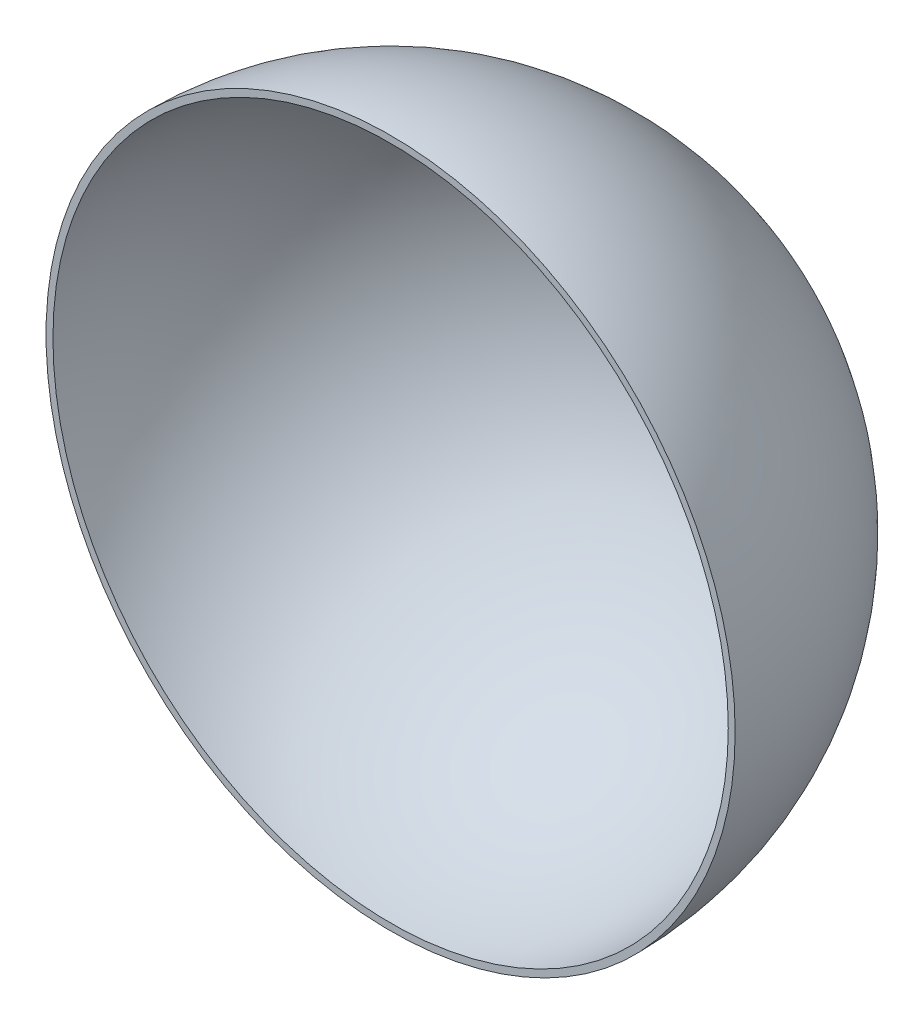
ISO-10303-21;
HEADER;
FILE_DESCRIPTION(('STEP AP214'),'2;1');
FILE_NAME('part.step','',(''),(''),'','','');
FILE_SCHEMA(('AUTOMOTIVE_DESIGN { 1 0 10303 214 1 1 1 1 }'));
ENDSEC;
DATA;
#1=APPLICATION_CONTEXT('core data for automotive mechanical design processes');
#2=APPLICATION_PROTOCOL_DEFINITION('international standard','automotive_design',2000,#1);
#3=PRODUCT_CONTEXT('',#1,'mechanical');
#4=PRODUCT('Part','Part','',(#3));
#5=PRODUCT_RELATED_PRODUCT_CATEGORY('part','',(#4));
#6=PRODUCT_DEFINITION_FORMATION('','',#4);
#7=PRODUCT_DEFINITION_CONTEXT('part definition',#1,'design');
#8=PRODUCT_DEFINITION('design','',#6,#7);
#9=PRODUCT_DEFINITION_SHAPE('','',#8);
#10=(LENGTH_UNIT() NAMED_UNIT(*) SI_UNIT(.MILLI.,.METRE.));
#11=(NAMED_UNIT(*) PLANE_ANGLE_UNIT() SI_UNIT($,.RADIAN.));
#12=(NAMED_UNIT(*) SI_UNIT($,.STERADIAN.) SOLID_ANGLE_UNIT());
#13=UNCERTAINTY_MEASURE_WITH_UNIT(LENGTH_MEASURE(1.E-05),#10,'distance_accuracy_value','');
#14=(GEOMETRIC_REPRESENTATION_CONTEXT(3) GLOBAL_UNCERTAINTY_ASSIGNED_CONTEXT((#13)) GLOBAL_UNIT_ASSIGNED_CONTEXT((#10,
#11,#12)) REPRESENTATION_CONTEXT('',''));
#15=CARTESIAN_POINT('',(0.,0.,0.));
#16=DIRECTION('',(0.,0.,1.));
#17=DIRECTION('',(1.,0.,0.));
#18=AXIS2_PLACEMENT_3D('',#15,#16,#17);
#19=CARTESIAN_POINT('',(0.,0.,0.));
#20=DIRECTION('',(0.,1.,0.));
#21=DIRECTION('',(1.,0.,0.));
#22=AXIS2_PLACEMENT_3D('',#19,#20,#21);
#23=SPHERICAL_SURFACE('',#22,100.);
#24=CARTESIAN_POINT('',(0.,0.,0.));
#25=DIRECTION('',(0.,0.,1.));
#26=DIRECTION('',(1.,0.,0.));
#27=AXIS2_PLACEMENT_3D('',#24,#25,#26);
#28=SPHERICAL_SURFACE('',#27,100.);
#29=CARTESIAN_POINT('',(0.,0.,0.));
#30=DIRECTION('',(0.,0.,1.));
#31=DIRECTION('',(1.,0.,0.));
#32=AXIS2_PLACEMENT_3D('',#29,#30,#31);
#33=CIRCLE('',#32,100.);
#34=CARTESIAN_POINT('',(100.,0.,0.));
#35=VERTEX_POINT('',#34);
#36=EDGE_CURVE('E44',#35,#35,#33,.T.);
#37=ORIENTED_EDGE('',*,*,#36,.F.);
#38=EDGE_LOOP('',(#37));
#39=FACE_BOUND('',#38,.T.);
#40=ADVANCED_FACE('F37',(#39),#28,.T.);
#41=CARTESIAN_POINT('',(0.,0.,0.));
#42=DIRECTION('',(0.,0.,1.));
#43=DIRECTION('',(1.,0.,0.));
#44=AXIS2_PLACEMENT_3D('',#41,#42,#43);
#45=PLANE('',#44);
#46=CARTESIAN_POINT('',(0.,0.,0.));
#47=DIRECTION('',(0.,0.,1.));
#48=DIRECTION('',(1.,0.,0.));
#49=AXIS2_PLACEMENT_3D('',#46,#47,#48);
#50=CIRCLE('',#49,98.);
#51=CARTESIAN_POINT('',(98.,0.,0.));
#52=VERTEX_POINT('',#51);
#53=EDGE_CURVE('E10',#52,#52,#50,.T.);
#54=ORIENTED_EDGE('',*,*,#53,.F.);
#55=EDGE_LOOP('',(#54));
#56=FACE_BOUND('',#55,.T.);
#57=ORIENTED_EDGE('',*,*,#36,.T.);
#58=EDGE_LOOP('',(#57));
#59=FACE_BOUND('',#58,.T.);
#60=ADVANCED_FACE('F51',(#56,#59),#45,.T.);
#61=CARTESIAN_POINT('',(0.,0.,0.));
#62=DIRECTION('',(0.,1.,0.));
#63=DIRECTION('',(1.,0.,0.));
#64=AXIS2_PLACEMENT_3D('',#61,#62,#63);
#65=SPHERICAL_SURFACE('',#64,98.);
#66=CARTESIAN_POINT('',(0.,0.,0.));
#67=DIRECTION('',(0.,0.,1.));
#68=DIRECTION('',(1.,0.,0.));
#69=AXIS2_PLACEMENT_3D('',#66,#67,#68);
#70=SPHERICAL_SURFACE('',#69,98.);
#71=ORIENTED_EDGE('',*,*,#53,.T.);
#72=EDGE_LOOP('',(#71));
#73=FACE_BOUND('',#72,.T.);
#74=ADVANCED_FACE('F57',(#73),#70,.F.);
#75=CLOSED_SHELL('',(#40,#60,#74));
#76=MANIFOLD_SOLID_BREP('B2',#75);
#77=ADVANCED_BREP_SHAPE_REPRESENTATION('',(#18,#76),#14);
#78=SHAPE_DEFINITION_REPRESENTATION(#9,#77);
ENDSEC;
END-ISO-10303-21;
